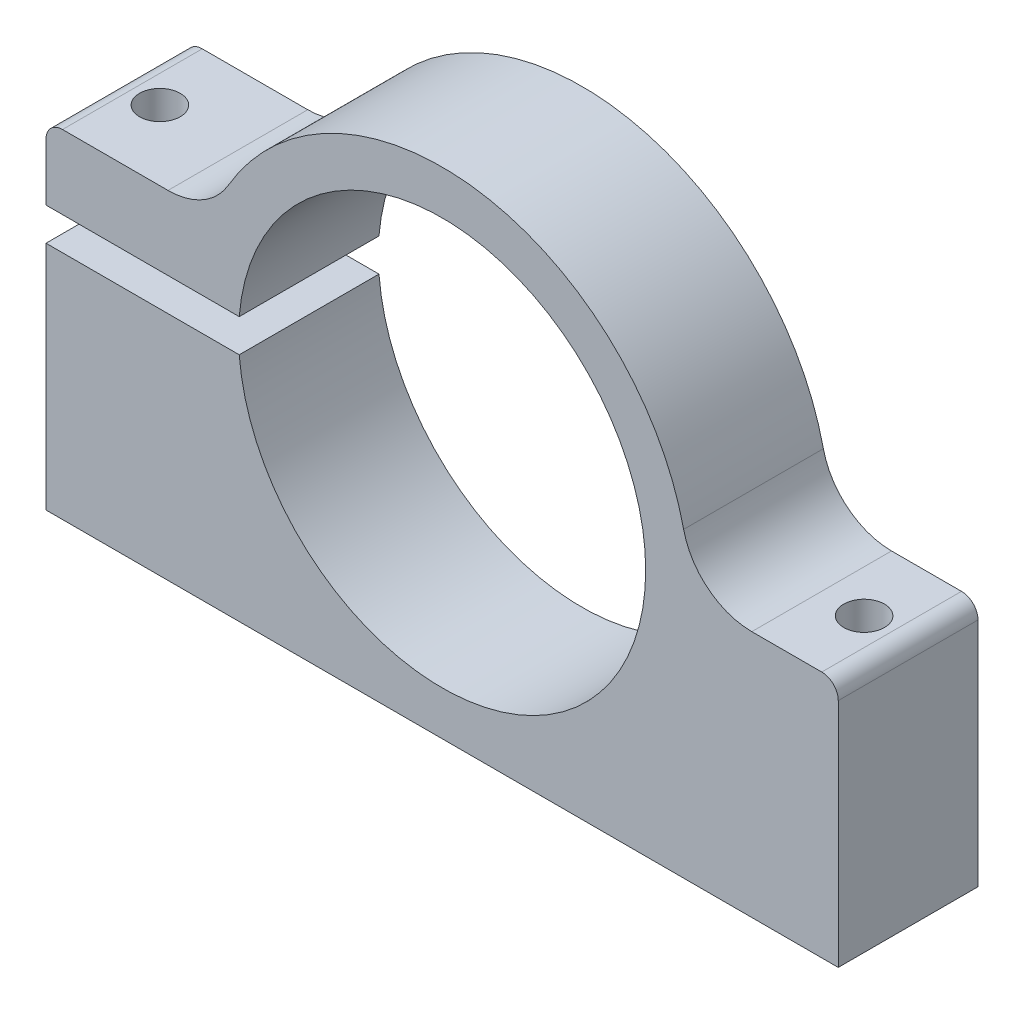
ISO-10303-21;
HEADER;
FILE_DESCRIPTION(('STEP AP214'),'2;1');
FILE_NAME('part.step','',(''),(''),'','','');
FILE_SCHEMA(('AUTOMOTIVE_DESIGN { 1 0 10303 214 1 1 1 1 }'));
ENDSEC;
DATA;
#1=APPLICATION_CONTEXT('core data for automotive mechanical design processes');
#2=APPLICATION_PROTOCOL_DEFINITION('international standard','automotive_design',2000,#1);
#3=PRODUCT_CONTEXT('',#1,'mechanical');
#4=PRODUCT('Part','Part','',(#3));
#5=PRODUCT_RELATED_PRODUCT_CATEGORY('part','',(#4));
#6=PRODUCT_DEFINITION_FORMATION('','',#4);
#7=PRODUCT_DEFINITION_CONTEXT('part definition',#1,'design');
#8=PRODUCT_DEFINITION('design','',#6,#7);
#9=PRODUCT_DEFINITION_SHAPE('','',#8);
#10=(LENGTH_UNIT() NAMED_UNIT(*) SI_UNIT(.MILLI.,.METRE.));
#11=(NAMED_UNIT(*) PLANE_ANGLE_UNIT() SI_UNIT($,.RADIAN.));
#12=(NAMED_UNIT(*) SI_UNIT($,.STERADIAN.) SOLID_ANGLE_UNIT());
#13=UNCERTAINTY_MEASURE_WITH_UNIT(LENGTH_MEASURE(1.E-05),#10,'distance_accuracy_value','');
#14=(GEOMETRIC_REPRESENTATION_CONTEXT(3) GLOBAL_UNCERTAINTY_ASSIGNED_CONTEXT((#13)) GLOBAL_UNIT_ASSIGNED_CONTEXT((#10,
#11,#12)) REPRESENTATION_CONTEXT('',''));
#15=CARTESIAN_POINT('',(0.,0.,0.));
#16=DIRECTION('',(0.,0.,1.));
#17=DIRECTION('',(1.,0.,0.));
#18=AXIS2_PLACEMENT_3D('',#15,#16,#17);
#19=CARTESIAN_POINT('',(32.,0.,0.));
#20=DIRECTION('',(0.,-1.,0.));
#21=DIRECTION('',(0.,0.,-1.));
#22=AXIS2_PLACEMENT_3D('',#19,#20,#21);
#23=CYLINDRICAL_SURFACE('',#22,1.85);
#24=CARTESIAN_POINT('',(32.,0.,0.));
#25=DIRECTION('',(0.,-1.,0.));
#26=DIRECTION('',(0.,0.,-1.));
#27=AXIS2_PLACEMENT_3D('',#24,#25,#26);
#28=CIRCLE('',#27,1.85);
#29=CARTESIAN_POINT('',(32.,0.,-1.85));
#30=VERTEX_POINT('',#29);
#31=EDGE_CURVE('E19',#30,#30,#28,.T.);
#32=ORIENTED_EDGE('',*,*,#31,.F.);
#33=EDGE_LOOP('',(#32));
#34=FACE_BOUND('',#33,.T.);
#35=CARTESIAN_POINT('',(32.,-22.5,0.));
#36=DIRECTION('',(0.,-1.,0.));
#37=DIRECTION('',(0.,0.,-1.));
#38=AXIS2_PLACEMENT_3D('',#35,#36,#37);
#39=CIRCLE('',#38,1.85);
#40=CARTESIAN_POINT('',(32.,-22.5,-1.85));
#41=VERTEX_POINT('',#40);
#42=EDGE_CURVE('E139',#41,#41,#39,.F.);
#43=ORIENTED_EDGE('',*,*,#42,.F.);
#44=EDGE_LOOP('',(#43));
#45=FACE_BOUND('',#44,.T.);
#46=ADVANCED_FACE('F16',(#34,#45),#23,.F.);
#47=CARTESIAN_POINT('',(-32.,8.2,0.));
#48=DIRECTION('',(0.,-1.,0.));
#49=DIRECTION('',(0.,0.,-1.));
#50=AXIS2_PLACEMENT_3D('',#47,#48,#49);
#51=CYLINDRICAL_SURFACE('',#50,1.85);
#52=CARTESIAN_POINT('',(-32.,-1.5,0.));
#53=DIRECTION('',(0.,-1.,0.));
#54=DIRECTION('',(0.,0.,-1.));
#55=AXIS2_PLACEMENT_3D('',#52,#53,#54);
#56=CIRCLE('',#55,1.85);
#57=CARTESIAN_POINT('',(-32.,-1.5,-1.85));
#58=VERTEX_POINT('',#57);
#59=EDGE_CURVE('E128',#58,#58,#56,.F.);
#60=ORIENTED_EDGE('',*,*,#59,.T.);
#61=EDGE_LOOP('',(#60));
#62=FACE_BOUND('',#61,.T.);
#63=CARTESIAN_POINT('',(-32.,-22.5,0.));
#64=DIRECTION('',(0.,-1.,0.));
#65=DIRECTION('',(0.,0.,-1.));
#66=AXIS2_PLACEMENT_3D('',#63,#64,#65);
#67=CIRCLE('',#66,1.85);
#68=CARTESIAN_POINT('',(-32.,-22.5,-1.85));
#69=VERTEX_POINT('',#68);
#70=EDGE_CURVE('E135',#69,#69,#67,.F.);
#71=ORIENTED_EDGE('',*,*,#70,.F.);
#72=EDGE_LOOP('',(#71));
#73=FACE_BOUND('',#72,.T.);
#74=ADVANCED_FACE('F466',(#62,#73),#51,.F.);
#75=CARTESIAN_POINT('',(-32.,8.2,0.));
#76=DIRECTION('',(0.,-1.,0.));
#77=DIRECTION('',(0.,0.,-1.));
#78=AXIS2_PLACEMENT_3D('',#75,#76,#77);
#79=CYLINDRICAL_SURFACE('',#78,1.85);
#80=CARTESIAN_POINT('',(-32.,8.2,0.));
#81=DIRECTION('',(0.,-1.,0.));
#82=DIRECTION('',(0.,0.,-1.));
#83=AXIS2_PLACEMENT_3D('',#80,#81,#82);
#84=CIRCLE('',#83,1.85);
#85=CARTESIAN_POINT('',(-32.,8.2,-1.85));
#86=VERTEX_POINT('',#85);
#87=EDGE_CURVE('E142',#86,#86,#84,.T.);
#88=ORIENTED_EDGE('',*,*,#87,.F.);
#89=EDGE_LOOP('',(#88));
#90=FACE_BOUND('',#89,.T.);
#91=CARTESIAN_POINT('',(-32.,1.5,0.));
#92=DIRECTION('',(0.,-1.,0.));
#93=DIRECTION('',(0.,0.,-1.));
#94=AXIS2_PLACEMENT_3D('',#91,#92,#93);
#95=CIRCLE('',#94,1.85);
#96=CARTESIAN_POINT('',(-32.,1.5,-1.85));
#97=VERTEX_POINT('',#96);
#98=EDGE_CURVE('E189',#97,#97,#95,.T.);
#99=ORIENTED_EDGE('',*,*,#98,.T.);
#100=EDGE_LOOP('',(#99));
#101=FACE_BOUND('',#100,.T.);
#102=ADVANCED_FACE('F458',(#90,#101),#79,.F.);
#103=CARTESIAN_POINT('',(34.5,-1.5,22.90572));
#104=DIRECTION('',(0.,0.,-1.));
#105=DIRECTION('',(-1.,0.,0.));
#106=AXIS2_PLACEMENT_3D('',#103,#104,#105);
#107=CYLINDRICAL_SURFACE('',#106,1.5);
#108=CARTESIAN_POINT('',(34.5,-1.5,6.35));
#109=DIRECTION('',(0.,0.,-1.));
#110=DIRECTION('',(-1.,0.,0.));
#111=AXIS2_PLACEMENT_3D('',#108,#109,#110);
#112=CIRCLE('',#111,1.5);
#113=CARTESIAN_POINT('',(36.,-1.5,6.35));
#114=VERTEX_POINT('',#113);
#115=CARTESIAN_POINT('',(34.5,0.,6.35));
#116=VERTEX_POINT('',#115);
#117=EDGE_CURVE('E187',#114,#116,#112,.F.);
#118=ORIENTED_EDGE('',*,*,#117,.F.);
#119=DIRECTION('',(0.,0.,-1.));
#120=VECTOR('',#119,1.);
#121=CARTESIAN_POINT('',(36.,-1.5,-6.35));
#122=LINE('',#121,#120);
#123=CARTESIAN_POINT('',(36.,-1.5,-6.35));
#124=VERTEX_POINT('',#123);
#125=EDGE_CURVE('E138',#124,#114,#122,.F.);
#126=ORIENTED_EDGE('',*,*,#125,.F.);
#127=CARTESIAN_POINT('',(34.5,-1.5,-6.35));
#128=DIRECTION('',(0.,0.,-1.));
#129=DIRECTION('',(-1.,0.,0.));
#130=AXIS2_PLACEMENT_3D('',#127,#128,#129);
#131=CIRCLE('',#130,1.5);
#132=CARTESIAN_POINT('',(34.5,0.,-6.35));
#133=VERTEX_POINT('',#132);
#134=EDGE_CURVE('E193',#124,#133,#131,.F.);
#135=ORIENTED_EDGE('',*,*,#134,.T.);
#136=DIRECTION('',(0.,0.,1.));
#137=VECTOR('',#136,1.);
#138=CARTESIAN_POINT('',(34.5,0.,-6.35));
#139=LINE('',#138,#137);
#140=EDGE_CURVE('E159',#116,#133,#139,.F.);
#141=ORIENTED_EDGE('',*,*,#140,.F.);
#142=EDGE_LOOP('',(#118,#126,#135,#141));
#143=FACE_BOUND('',#142,.T.);
#144=ADVANCED_FACE('F316',(#143),#107,.T.);
#145=CARTESIAN_POINT('',(36.,0.,-6.35));
#146=DIRECTION('',(0.,1.,0.));
#147=DIRECTION('',(0.,0.,1.));
#148=AXIS2_PLACEMENT_3D('',#145,#146,#147);
#149=PLANE('',#148);
#150=ORIENTED_EDGE('',*,*,#31,.T.);
#151=EDGE_LOOP('',(#150));
#152=FACE_BOUND('',#151,.T.);
#153=DIRECTION('',(0.,0.,1.));
#154=VECTOR('',#153,1.);
#155=CARTESIAN_POINT('',(28.1424945589406,0.,-22.90572));
#156=LINE('',#155,#154);
#157=CARTESIAN_POINT('',(28.1424945589406,0.,-6.35));
#158=VERTEX_POINT('',#157);
#159=CARTESIAN_POINT('',(28.1424945589406,0.,6.35));
#160=VERTEX_POINT('',#159);
#161=EDGE_CURVE('E99',#158,#160,#156,.T.);
#162=ORIENTED_EDGE('',*,*,#161,.T.);
#163=DIRECTION('',(1.,0.,0.));
#164=VECTOR('',#163,1.);
#165=CARTESIAN_POINT('',(0.,0.,6.35));
#166=LINE('',#165,#164);
#167=EDGE_CURVE('E186',#116,#160,#166,.F.);
#168=ORIENTED_EDGE('',*,*,#167,.F.);
#169=ORIENTED_EDGE('',*,*,#140,.T.);
#170=DIRECTION('',(1.,0.,0.));
#171=VECTOR('',#170,1.);
#172=CARTESIAN_POINT('',(0.,0.,-6.35));
#173=LINE('',#172,#171);
#174=EDGE_CURVE('E126',#133,#158,#173,.F.);
#175=ORIENTED_EDGE('',*,*,#174,.T.);
#176=EDGE_LOOP('',(#162,#168,#169,#175));
#177=FACE_BOUND('',#176,.T.);
#178=ADVANCED_FACE('F319',(#152,#177),#149,.T.);
#179=CARTESIAN_POINT('',(28.1424945589406,6.35,-22.90572));
#180=DIRECTION('',(0.,0.,1.));
#181=DIRECTION('',(1.,0.,0.));
#182=AXIS2_PLACEMENT_3D('',#179,#180,#181);
#183=CYLINDRICAL_SURFACE('',#182,6.35);
#184=CARTESIAN_POINT('',(28.1424945589406,6.35,6.35));
#185=DIRECTION('',(0.,0.,1.));
#186=DIRECTION('',(1.,0.,0.));
#187=AXIS2_PLACEMENT_3D('',#184,#185,#186);
#188=CIRCLE('',#187,6.35);
#189=CARTESIAN_POINT('',(21.9482193267301,4.9523396880416,6.35));
#190=VERTEX_POINT('',#189);
#191=EDGE_CURVE('E184',#160,#190,#188,.F.);
#192=ORIENTED_EDGE('',*,*,#191,.F.);
#193=ORIENTED_EDGE('',*,*,#161,.F.);
#194=CARTESIAN_POINT('',(28.1424945589406,6.35,-6.35));
#195=DIRECTION('',(0.,0.,1.));
#196=DIRECTION('',(1.,0.,0.));
#197=AXIS2_PLACEMENT_3D('',#194,#195,#196);
#198=CIRCLE('',#197,6.35);
#199=CARTESIAN_POINT('',(21.9482193267301,4.95233968804159,-6.35));
#200=VERTEX_POINT('',#199);
#201=EDGE_CURVE('E119',#158,#200,#198,.F.);
#202=ORIENTED_EDGE('',*,*,#201,.T.);
#203=DIRECTION('',(0.,0.,1.));
#204=VECTOR('',#203,1.);
#205=CARTESIAN_POINT('',(21.9482193267301,4.9523396880416,-6.35));
#206=LINE('',#205,#204);
#207=EDGE_CURVE('E106',#190,#200,#206,.F.);
#208=ORIENTED_EDGE('',*,*,#207,.F.);
#209=EDGE_LOOP('',(#192,#193,#202,#208));
#210=FACE_BOUND('',#209,.T.);
#211=ADVANCED_FACE('F125',(#210),#183,.F.);
#212=CARTESIAN_POINT('',(0.,0.,-6.35));
#213=DIRECTION('',(0.,0.,1.));
#214=DIRECTION('',(1.,0.,0.));
#215=AXIS2_PLACEMENT_3D('',#212,#213,#214);
#216=CYLINDRICAL_SURFACE('',#215,22.5);
#217=DIRECTION('',(0.,0.,1.));
#218=VECTOR('',#217,1.);
#219=CARTESIAN_POINT('',(-19.428961339853,11.347487001733,-22.90572));
#220=LINE('',#219,#218);
#221=CARTESIAN_POINT('',(-19.4289613398529,11.347487001733,-6.35));
#222=VERTEX_POINT('',#221);
#223=CARTESIAN_POINT('',(-19.4289613398529,11.347487001733,6.35));
#224=VERTEX_POINT('',#223);
#225=EDGE_CURVE('E112',#222,#224,#220,.T.);
#226=ORIENTED_EDGE('',*,*,#225,.T.);
#227=CARTESIAN_POINT('',(0.,0.,6.35));
#228=DIRECTION('',(0.,0.,1.));
#229=DIRECTION('',(1.,0.,0.));
#230=AXIS2_PLACEMENT_3D('',#227,#228,#229);
#231=CIRCLE('',#230,22.5);
#232=EDGE_CURVE('E111',#190,#224,#231,.T.);
#233=ORIENTED_EDGE('',*,*,#232,.F.);
#234=ORIENTED_EDGE('',*,*,#207,.T.);
#235=CARTESIAN_POINT('',(0.,0.,-6.35));
#236=DIRECTION('',(0.,0.,1.));
#237=DIRECTION('',(1.,0.,0.));
#238=AXIS2_PLACEMENT_3D('',#235,#236,#237);
#239=CIRCLE('',#238,22.5);
#240=EDGE_CURVE('E110',#200,#222,#239,.T.);
#241=ORIENTED_EDGE('',*,*,#240,.T.);
#242=EDGE_LOOP('',(#226,#233,#234,#241));
#243=FACE_BOUND('',#242,.T.);
#244=ADVANCED_FACE('F109',(#243),#216,.T.);
#245=CARTESIAN_POINT('',(-24.9122459846558,14.55,-22.90572));
#246=DIRECTION('',(0.,0.,1.));
#247=DIRECTION('',(1.,0.,0.));
#248=AXIS2_PLACEMENT_3D('',#245,#246,#247);
#249=CYLINDRICAL_SURFACE('',#248,6.35);
#250=CARTESIAN_POINT('',(-24.9122459846558,14.55,6.35));
#251=DIRECTION('',(0.,0.,1.));
#252=DIRECTION('',(1.,0.,0.));
#253=AXIS2_PLACEMENT_3D('',#250,#251,#252);
#254=CIRCLE('',#253,6.35);
#255=CARTESIAN_POINT('',(-24.9122459846558,8.2,6.35));
#256=VERTEX_POINT('',#255);
#257=EDGE_CURVE('E181',#224,#256,#254,.F.);
#258=ORIENTED_EDGE('',*,*,#257,.F.);
#259=ORIENTED_EDGE('',*,*,#225,.F.);
#260=CARTESIAN_POINT('',(-24.9122459846558,14.55,-6.35));
#261=DIRECTION('',(0.,0.,1.));
#262=DIRECTION('',(1.,0.,0.));
#263=AXIS2_PLACEMENT_3D('',#260,#261,#262);
#264=CIRCLE('',#263,6.35);
#265=CARTESIAN_POINT('',(-24.9122459846558,8.2,-6.35));
#266=VERTEX_POINT('',#265);
#267=EDGE_CURVE('E123',#222,#266,#264,.F.);
#268=ORIENTED_EDGE('',*,*,#267,.T.);
#269=DIRECTION('',(0.,0.,1.));
#270=VECTOR('',#269,1.);
#271=CARTESIAN_POINT('',(-24.9122459846558,8.2,-6.35));
#272=LINE('',#271,#270);
#273=EDGE_CURVE('E145',#256,#266,#272,.F.);
#274=ORIENTED_EDGE('',*,*,#273,.F.);
#275=EDGE_LOOP('',(#258,#259,#268,#274));
#276=FACE_BOUND('',#275,.T.);
#277=ADVANCED_FACE('F321',(#276),#249,.F.);
#278=CARTESIAN_POINT('',(-20.952565475378,8.2,-6.35));
#279=DIRECTION('',(0.,1.,0.));
#280=DIRECTION('',(0.,0.,1.));
#281=AXIS2_PLACEMENT_3D('',#278,#279,#280);
#282=PLANE('',#281);
#283=ORIENTED_EDGE('',*,*,#87,.T.);
#284=EDGE_LOOP('',(#283));
#285=FACE_BOUND('',#284,.T.);
#286=ORIENTED_EDGE('',*,*,#273,.T.);
#287=DIRECTION('',(1.,0.,0.));
#288=VECTOR('',#287,1.);
#289=CARTESIAN_POINT('',(0.,8.2,-6.35));
#290=LINE('',#289,#288);
#291=CARTESIAN_POINT('',(-34.5,8.2,-6.35));
#292=VERTEX_POINT('',#291);
#293=EDGE_CURVE('E200',#266,#292,#290,.F.);
#294=ORIENTED_EDGE('',*,*,#293,.T.);
#295=DIRECTION('',(0.,0.,-1.));
#296=VECTOR('',#295,1.);
#297=CARTESIAN_POINT('',(-34.5,8.2,22.90572));
#298=LINE('',#297,#296);
#299=CARTESIAN_POINT('',(-34.5,8.2,6.35));
#300=VERTEX_POINT('',#299);
#301=EDGE_CURVE('E144',#300,#292,#298,.T.);
#302=ORIENTED_EDGE('',*,*,#301,.F.);
#303=DIRECTION('',(1.,0.,0.));
#304=VECTOR('',#303,1.);
#305=CARTESIAN_POINT('',(0.,8.2,6.35));
#306=LINE('',#305,#304);
#307=EDGE_CURVE('E180',#256,#300,#306,.F.);
#308=ORIENTED_EDGE('',*,*,#307,.F.);
#309=EDGE_LOOP('',(#286,#294,#302,#308));
#310=FACE_BOUND('',#309,.T.);
#311=ADVANCED_FACE('F248',(#285,#310),#282,.T.);
#312=CARTESIAN_POINT('',(-34.5,6.7,22.90572));
#313=DIRECTION('',(0.,0.,-1.));
#314=DIRECTION('',(-1.,0.,0.));
#315=AXIS2_PLACEMENT_3D('',#312,#313,#314);
#316=CYLINDRICAL_SURFACE('',#315,1.5);
#317=CARTESIAN_POINT('',(-34.5,6.7,6.35));
#318=DIRECTION('',(0.,0.,-1.));
#319=DIRECTION('',(-1.,0.,0.));
#320=AXIS2_PLACEMENT_3D('',#317,#318,#319);
#321=CIRCLE('',#320,1.5);
#322=CARTESIAN_POINT('',(-36.,6.7,6.35));
#323=VERTEX_POINT('',#322);
#324=EDGE_CURVE('E177',#300,#323,#321,.F.);
#325=ORIENTED_EDGE('',*,*,#324,.F.);
#326=ORIENTED_EDGE('',*,*,#301,.T.);
#327=CARTESIAN_POINT('',(-34.5,6.7,-6.35));
#328=DIRECTION('',(0.,0.,-1.));
#329=DIRECTION('',(-1.,0.,0.));
#330=AXIS2_PLACEMENT_3D('',#327,#328,#329);
#331=CIRCLE('',#330,1.5);
#332=CARTESIAN_POINT('',(-36.,6.7,-6.35));
#333=VERTEX_POINT('',#332);
#334=EDGE_CURVE('E197',#292,#333,#331,.F.);
#335=ORIENTED_EDGE('',*,*,#334,.T.);
#336=DIRECTION('',(0.,0.,1.));
#337=VECTOR('',#336,1.);
#338=CARTESIAN_POINT('',(-36.,6.7,-6.35));
#339=LINE('',#338,#337);
#340=EDGE_CURVE('E148',#323,#333,#339,.F.);
#341=ORIENTED_EDGE('',*,*,#340,.F.);
#342=EDGE_LOOP('',(#325,#326,#335,#341));
#343=FACE_BOUND('',#342,.T.);
#344=ADVANCED_FACE('F247',(#343),#316,.T.);
#345=CARTESIAN_POINT('',(-36.,8.2,-6.35));
#346=DIRECTION('',(-1.,0.,0.));
#347=DIRECTION('',(0.,0.,1.));
#348=AXIS2_PLACEMENT_3D('',#345,#346,#347);
#349=PLANE('',#348);
#350=DIRECTION('',(0.,0.,1.));
#351=VECTOR('',#350,1.);
#352=CARTESIAN_POINT('',(-36.,1.5,-7.62));
#353=LINE('',#352,#351);
#354=CARTESIAN_POINT('',(-36.,1.5,-6.35));
#355=VERTEX_POINT('',#354);
#356=CARTESIAN_POINT('',(-36.,1.5,6.35));
#357=VERTEX_POINT('',#356);
#358=EDGE_CURVE('E196',#355,#357,#353,.T.);
#359=ORIENTED_EDGE('',*,*,#358,.T.);
#360=DIRECTION('',(0.,1.,0.));
#361=VECTOR('',#360,1.);
#362=CARTESIAN_POINT('',(-36.,0.,6.35));
#363=LINE('',#362,#361);
#364=EDGE_CURVE('E179',#323,#357,#363,.F.);
#365=ORIENTED_EDGE('',*,*,#364,.F.);
#366=ORIENTED_EDGE('',*,*,#340,.T.);
#367=DIRECTION('',(0.,1.,0.));
#368=VECTOR('',#367,1.);
#369=CARTESIAN_POINT('',(-36.,0.,-6.35));
#370=LINE('',#369,#368);
#371=EDGE_CURVE('E199',#333,#355,#370,.F.);
#372=ORIENTED_EDGE('',*,*,#371,.T.);
#373=EDGE_LOOP('',(#359,#365,#366,#372));
#374=FACE_BOUND('',#373,.T.);
#375=ADVANCED_FACE('F242',(#374),#349,.T.);
#376=CARTESIAN_POINT('',(-36.,8.2,-6.35));
#377=DIRECTION('',(-1.,0.,0.));
#378=DIRECTION('',(0.,0.,1.));
#379=AXIS2_PLACEMENT_3D('',#376,#377,#378);
#380=PLANE('',#379);
#381=DIRECTION('',(0.,0.,-1.));
#382=VECTOR('',#381,1.);
#383=CARTESIAN_POINT('',(-36.,-22.5,-6.35));
#384=LINE('',#383,#382);
#385=CARTESIAN_POINT('',(-36.,-22.5,6.35));
#386=VERTEX_POINT('',#385);
#387=CARTESIAN_POINT('',(-36.,-22.5,-6.35));
#388=VERTEX_POINT('',#387);
#389=EDGE_CURVE('E141',#386,#388,#384,.T.);
#390=ORIENTED_EDGE('',*,*,#389,.F.);
#391=DIRECTION('',(0.,1.,0.));
#392=VECTOR('',#391,1.);
#393=CARTESIAN_POINT('',(-36.,0.,6.35));
#394=LINE('',#393,#392);
#395=CARTESIAN_POINT('',(-36.,-1.5,6.35));
#396=VERTEX_POINT('',#395);
#397=EDGE_CURVE('E218',#396,#386,#394,.F.);
#398=ORIENTED_EDGE('',*,*,#397,.F.);
#399=DIRECTION('',(0.,0.,-1.));
#400=VECTOR('',#399,1.);
#401=CARTESIAN_POINT('',(-36.,-1.5,-7.62));
#402=LINE('',#401,#400);
#403=CARTESIAN_POINT('',(-36.,-1.5,-6.35));
#404=VERTEX_POINT('',#403);
#405=EDGE_CURVE('E134',#396,#404,#402,.T.);
#406=ORIENTED_EDGE('',*,*,#405,.T.);
#407=DIRECTION('',(0.,1.,0.));
#408=VECTOR('',#407,1.);
#409=CARTESIAN_POINT('',(-36.,0.,-6.35));
#410=LINE('',#409,#408);
#411=EDGE_CURVE('E165',#404,#388,#410,.F.);
#412=ORIENTED_EDGE('',*,*,#411,.T.);
#413=EDGE_LOOP('',(#390,#398,#406,#412));
#414=FACE_BOUND('',#413,.T.);
#415=ADVANCED_FACE('F299',(#414),#380,.T.);
#416=CARTESIAN_POINT('',(-36.,-22.5,-6.35));
#417=DIRECTION('',(0.,-1.,0.));
#418=DIRECTION('',(0.,0.,-1.));
#419=AXIS2_PLACEMENT_3D('',#416,#417,#418);
#420=PLANE('',#419);
#421=ORIENTED_EDGE('',*,*,#70,.T.);
#422=EDGE_LOOP('',(#421));
#423=FACE_BOUND('',#422,.T.);
#424=ORIENTED_EDGE('',*,*,#42,.T.);
#425=EDGE_LOOP('',(#424));
#426=FACE_BOUND('',#425,.T.);
#427=DIRECTION('',(1.,0.,0.));
#428=VECTOR('',#427,1.);
#429=CARTESIAN_POINT('',(0.,-22.5,6.35));
#430=LINE('',#429,#428);
#431=CARTESIAN_POINT('',(36.,-22.5,6.35));
#432=VERTEX_POINT('',#431);
#433=EDGE_CURVE('E214',#386,#432,#430,.T.);
#434=ORIENTED_EDGE('',*,*,#433,.F.);
#435=ORIENTED_EDGE('',*,*,#389,.T.);
#436=DIRECTION('',(1.,0.,0.));
#437=VECTOR('',#436,1.);
#438=CARTESIAN_POINT('',(0.,-22.5,-6.35));
#439=LINE('',#438,#437);
#440=CARTESIAN_POINT('',(36.,-22.5,-6.35));
#441=VERTEX_POINT('',#440);
#442=EDGE_CURVE('E161',#388,#441,#439,.T.);
#443=ORIENTED_EDGE('',*,*,#442,.T.);
#444=DIRECTION('',(0.,0.,-1.));
#445=VECTOR('',#444,1.);
#446=CARTESIAN_POINT('',(36.,-22.5,-6.35));
#447=LINE('',#446,#445);
#448=EDGE_CURVE('E209',#432,#441,#447,.T.);
#449=ORIENTED_EDGE('',*,*,#448,.F.);
#450=EDGE_LOOP('',(#434,#435,#443,#449));
#451=FACE_BOUND('',#450,.T.);
#452=ADVANCED_FACE('F294',(#423,#426,#451),#420,.T.);
#453=CARTESIAN_POINT('',(36.,-22.5,-6.35));
#454=DIRECTION('',(1.,0.,0.));
#455=DIRECTION('',(0.,0.,-1.));
#456=AXIS2_PLACEMENT_3D('',#453,#454,#455);
#457=PLANE('',#456);
#458=ORIENTED_EDGE('',*,*,#448,.T.);
#459=DIRECTION('',(0.,1.,0.));
#460=VECTOR('',#459,1.);
#461=CARTESIAN_POINT('',(36.,0.,-6.35));
#462=LINE('',#461,#460);
#463=EDGE_CURVE('E164',#441,#124,#462,.T.);
#464=ORIENTED_EDGE('',*,*,#463,.T.);
#465=ORIENTED_EDGE('',*,*,#125,.T.);
#466=DIRECTION('',(0.,1.,0.));
#467=VECTOR('',#466,1.);
#468=CARTESIAN_POINT('',(36.,0.,6.35));
#469=LINE('',#468,#467);
#470=EDGE_CURVE('E217',#432,#114,#469,.T.);
#471=ORIENTED_EDGE('',*,*,#470,.F.);
#472=EDGE_LOOP('',(#458,#464,#465,#471));
#473=FACE_BOUND('',#472,.T.);
#474=ADVANCED_FACE('F345',(#473),#457,.T.);
#475=CARTESIAN_POINT('',(-36.,-1.5,-7.62));
#476=DIRECTION('',(0.,-1.,0.));
#477=DIRECTION('',(0.,0.,-1.));
#478=AXIS2_PLACEMENT_3D('',#475,#476,#477);
#479=PLANE('',#478);
#480=ORIENTED_EDGE('',*,*,#59,.F.);
#481=EDGE_LOOP('',(#480));
#482=FACE_BOUND('',#481,.T.);
#483=ORIENTED_EDGE('',*,*,#405,.F.);
#484=DIRECTION('',(1.,0.,0.));
#485=VECTOR('',#484,1.);
#486=CARTESIAN_POINT('',(0.,-1.5,6.35));
#487=LINE('',#486,#485);
#488=CARTESIAN_POINT('',(-18.4390889145858,-1.5,6.35));
#489=VERTEX_POINT('',#488);
#490=EDGE_CURVE('E227',#489,#396,#487,.F.);
#491=ORIENTED_EDGE('',*,*,#490,.F.);
#492=DIRECTION('',(0.,0.,1.));
#493=VECTOR('',#492,1.);
#494=CARTESIAN_POINT('',(-18.4390889145858,-1.49999999999999,-7.62));
#495=LINE('',#494,#493);
#496=CARTESIAN_POINT('',(-18.4390889145858,-1.5,-6.35));
#497=VERTEX_POINT('',#496);
#498=EDGE_CURVE('E176',#489,#497,#495,.F.);
#499=ORIENTED_EDGE('',*,*,#498,.T.);
#500=DIRECTION('',(1.,0.,0.));
#501=VECTOR('',#500,1.);
#502=CARTESIAN_POINT('',(0.,-1.5,-6.35));
#503=LINE('',#502,#501);
#504=EDGE_CURVE('E170',#497,#404,#503,.F.);
#505=ORIENTED_EDGE('',*,*,#504,.T.);
#506=EDGE_LOOP('',(#483,#491,#499,#505));
#507=FACE_BOUND('',#506,.T.);
#508=ADVANCED_FACE('F271',(#482,#507),#479,.F.);
#509=CARTESIAN_POINT('',(0.,0.,-6.35));
#510=DIRECTION('',(0.,0.,1.));
#511=DIRECTION('',(1.,0.,0.));
#512=AXIS2_PLACEMENT_3D('',#509,#510,#511);
#513=PLANE('',#512);
#514=ORIENTED_EDGE('',*,*,#463,.F.);
#515=ORIENTED_EDGE('',*,*,#442,.F.);
#516=ORIENTED_EDGE('',*,*,#411,.F.);
#517=ORIENTED_EDGE('',*,*,#504,.F.);
#518=CARTESIAN_POINT('',(0.,0.,-6.35));
#519=DIRECTION('',(0.,0.,1.));
#520=DIRECTION('',(1.,0.,0.));
#521=AXIS2_PLACEMENT_3D('',#518,#519,#520);
#522=CIRCLE('',#521,18.5);
#523=CARTESIAN_POINT('',(-18.4390889145858,1.5,-6.35));
#524=VERTEX_POINT('',#523);
#525=EDGE_CURVE('E173',#497,#524,#522,.T.);
#526=ORIENTED_EDGE('',*,*,#525,.T.);
#527=DIRECTION('',(1.,0.,0.));
#528=VECTOR('',#527,1.);
#529=CARTESIAN_POINT('',(0.,1.5,-6.35));
#530=LINE('',#529,#528);
#531=EDGE_CURVE('E192',#524,#355,#530,.F.);
#532=ORIENTED_EDGE('',*,*,#531,.T.);
#533=ORIENTED_EDGE('',*,*,#371,.F.);
#534=ORIENTED_EDGE('',*,*,#334,.F.);
#535=ORIENTED_EDGE('',*,*,#293,.F.);
#536=ORIENTED_EDGE('',*,*,#267,.F.);
#537=ORIENTED_EDGE('',*,*,#240,.F.);
#538=ORIENTED_EDGE('',*,*,#201,.F.);
#539=ORIENTED_EDGE('',*,*,#174,.F.);
#540=ORIENTED_EDGE('',*,*,#134,.F.);
#541=EDGE_LOOP('',(#514,#515,#516,#517,#526,#532,#533,#534,#535,#536,#537,#538,#539,#540));
#542=FACE_BOUND('',#541,.T.);
#543=ADVANCED_FACE('F117',(#542),#513,.F.);
#544=CARTESIAN_POINT('',(0.,1.5,-7.62));
#545=DIRECTION('',(0.,1.,0.));
#546=DIRECTION('',(0.,0.,1.));
#547=AXIS2_PLACEMENT_3D('',#544,#545,#546);
#548=PLANE('',#547);
#549=ORIENTED_EDGE('',*,*,#98,.F.);
#550=EDGE_LOOP('',(#549));
#551=FACE_BOUND('',#550,.T.);
#552=DIRECTION('',(0.,0.,1.));
#553=VECTOR('',#552,1.);
#554=CARTESIAN_POINT('',(-18.4390889145858,1.49999999999999,-7.62));
#555=LINE('',#554,#553);
#556=CARTESIAN_POINT('',(-18.4390889145858,1.5,6.35));
#557=VERTEX_POINT('',#556);
#558=EDGE_CURVE('E25',#524,#557,#555,.T.);
#559=ORIENTED_EDGE('',*,*,#558,.T.);
#560=DIRECTION('',(1.,0.,0.));
#561=VECTOR('',#560,1.);
#562=CARTESIAN_POINT('',(0.,1.5,6.35));
#563=LINE('',#562,#561);
#564=EDGE_CURVE('E33',#357,#557,#563,.T.);
#565=ORIENTED_EDGE('',*,*,#564,.F.);
#566=ORIENTED_EDGE('',*,*,#358,.F.);
#567=ORIENTED_EDGE('',*,*,#531,.F.);
#568=EDGE_LOOP('',(#559,#565,#566,#567));
#569=FACE_BOUND('',#568,.T.);
#570=ADVANCED_FACE('F284',(#551,#569),#548,.F.);
#571=CARTESIAN_POINT('',(0.,0.,6.35));
#572=DIRECTION('',(0.,0.,1.));
#573=DIRECTION('',(1.,0.,0.));
#574=AXIS2_PLACEMENT_3D('',#571,#572,#573);
#575=PLANE('',#574);
#576=ORIENTED_EDGE('',*,*,#433,.T.);
#577=ORIENTED_EDGE('',*,*,#470,.T.);
#578=ORIENTED_EDGE('',*,*,#117,.T.);
#579=ORIENTED_EDGE('',*,*,#167,.T.);
#580=ORIENTED_EDGE('',*,*,#191,.T.);
#581=ORIENTED_EDGE('',*,*,#232,.T.);
#582=ORIENTED_EDGE('',*,*,#257,.T.);
#583=ORIENTED_EDGE('',*,*,#307,.T.);
#584=ORIENTED_EDGE('',*,*,#324,.T.);
#585=ORIENTED_EDGE('',*,*,#364,.T.);
#586=ORIENTED_EDGE('',*,*,#564,.T.);
#587=CARTESIAN_POINT('',(0.,0.,6.35));
#588=DIRECTION('',(0.,0.,1.));
#589=DIRECTION('',(1.,0.,0.));
#590=AXIS2_PLACEMENT_3D('',#587,#588,#589);
#591=CIRCLE('',#590,18.5);
#592=EDGE_CURVE('E11',#557,#489,#591,.F.);
#593=ORIENTED_EDGE('',*,*,#592,.T.);
#594=ORIENTED_EDGE('',*,*,#490,.T.);
#595=ORIENTED_EDGE('',*,*,#397,.T.);
#596=EDGE_LOOP('',(#576,#577,#578,#579,#580,#581,#582,#583,#584,#585,#586,#593,#594,#595));
#597=FACE_BOUND('',#596,.T.);
#598=ADVANCED_FACE('F300',(#597),#575,.T.);
#599=CARTESIAN_POINT('',(0.,0.,-7.62));
#600=DIRECTION('',(0.,0.,1.));
#601=DIRECTION('',(1.,0.,0.));
#602=AXIS2_PLACEMENT_3D('',#599,#600,#601);
#603=CYLINDRICAL_SURFACE('',#602,18.5);
#604=ORIENTED_EDGE('',*,*,#558,.F.);
#605=ORIENTED_EDGE('',*,*,#525,.F.);
#606=ORIENTED_EDGE('',*,*,#498,.F.);
#607=ORIENTED_EDGE('',*,*,#592,.F.);
#608=EDGE_LOOP('',(#604,#605,#606,#607));
#609=FACE_BOUND('',#608,.T.);
#610=ADVANCED_FACE('F282',(#609),#603,.F.);
#611=CLOSED_SHELL('',(#46,#74,#102,#144,#178,#211,#244,#277,#311,#344,#375,#415,#452,#474,#508,
#543,#570,#598,#610));
#612=MANIFOLD_SOLID_BREP('B1',#611);
#613=ADVANCED_BREP_SHAPE_REPRESENTATION('',(#18,#612),#14);
#614=SHAPE_DEFINITION_REPRESENTATION(#9,#613);
ENDSEC;
END-ISO-10303-21;
